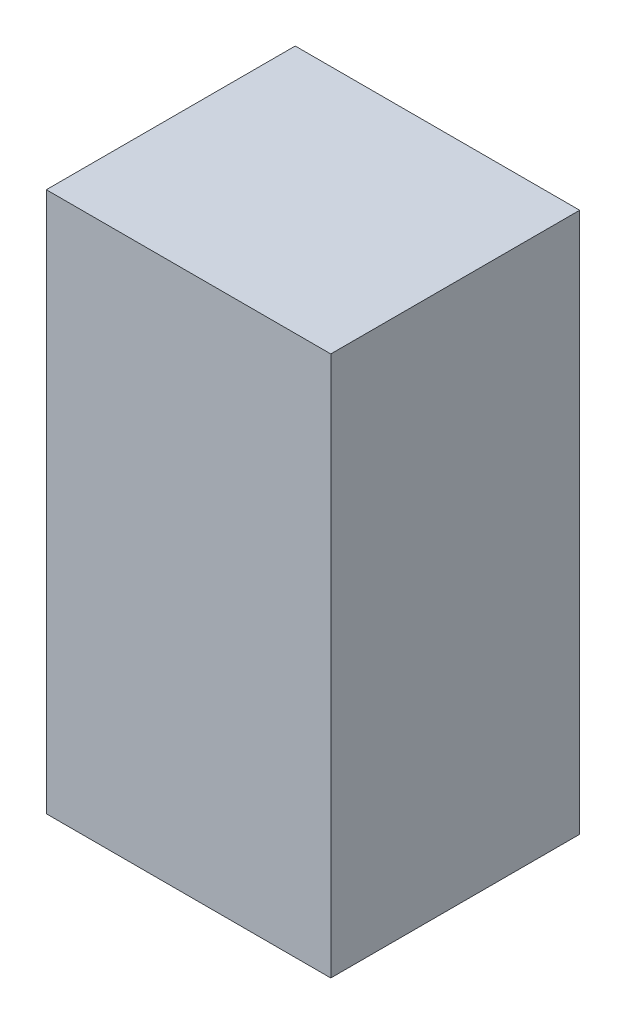
ISO-10303-21;
HEADER;
FILE_DESCRIPTION(('STEP AP214'),'2;1');
FILE_NAME('part.step','',(''),(''),'','','');
FILE_SCHEMA(('AUTOMOTIVE_DESIGN { 1 0 10303 214 1 1 1 1 }'));
ENDSEC;
DATA;
#1=APPLICATION_CONTEXT('core data for automotive mechanical design processes');
#2=APPLICATION_PROTOCOL_DEFINITION('international standard','automotive_design',2000,#1);
#3=PRODUCT_CONTEXT('',#1,'mechanical');
#4=PRODUCT('Part','Part','',(#3));
#5=PRODUCT_RELATED_PRODUCT_CATEGORY('part','',(#4));
#6=PRODUCT_DEFINITION_FORMATION('','',#4);
#7=PRODUCT_DEFINITION_CONTEXT('part definition',#1,'design');
#8=PRODUCT_DEFINITION('design','',#6,#7);
#9=PRODUCT_DEFINITION_SHAPE('','',#8);
#10=(LENGTH_UNIT() NAMED_UNIT(*) SI_UNIT(.MILLI.,.METRE.));
#11=(NAMED_UNIT(*) PLANE_ANGLE_UNIT() SI_UNIT($,.RADIAN.));
#12=(NAMED_UNIT(*) SI_UNIT($,.STERADIAN.) SOLID_ANGLE_UNIT());
#13=UNCERTAINTY_MEASURE_WITH_UNIT(LENGTH_MEASURE(1.E-05),#10,'distance_accuracy_value','');
#14=(GEOMETRIC_REPRESENTATION_CONTEXT(3) GLOBAL_UNCERTAINTY_ASSIGNED_CONTEXT((#13)) GLOBAL_UNIT_ASSIGNED_CONTEXT((#10,
#11,#12)) REPRESENTATION_CONTEXT('',''));
#15=CARTESIAN_POINT('',(0.,0.,0.));
#16=DIRECTION('',(0.,0.,1.));
#17=DIRECTION('',(1.,0.,0.));
#18=AXIS2_PLACEMENT_3D('',#15,#16,#17);
#19=CARTESIAN_POINT('',(-1.524,-2.8956,2.667));
#20=DIRECTION('',(0.,0.,1.));
#21=DIRECTION('',(1.,0.,0.));
#22=AXIS2_PLACEMENT_3D('',#19,#20,#21);
#23=PLANE('',#22);
#24=DIRECTION('',(1.,0.,0.));
#25=VECTOR('',#24,1.);
#26=CARTESIAN_POINT('',(-1.524,2.8956,2.667));
#27=LINE('',#26,#25);
#28=CARTESIAN_POINT('',(-1.524,2.8956,2.667));
#29=VERTEX_POINT('',#28);
#30=CARTESIAN_POINT('',(1.524,2.8956,2.667));
#31=VERTEX_POINT('',#30);
#32=EDGE_CURVE('E53',#29,#31,#27,.T.);
#33=ORIENTED_EDGE('',*,*,#32,.F.);
#34=DIRECTION('',(0.,1.,0.));
#35=VECTOR('',#34,1.);
#36=CARTESIAN_POINT('',(-1.524,-2.8956,2.667));
#37=LINE('',#36,#35);
#38=CARTESIAN_POINT('',(-1.524,-2.8956,2.667));
#39=VERTEX_POINT('',#38);
#40=EDGE_CURVE('E68',#39,#29,#37,.T.);
#41=ORIENTED_EDGE('',*,*,#40,.F.);
#42=DIRECTION('',(1.,0.,0.));
#43=VECTOR('',#42,1.);
#44=CARTESIAN_POINT('',(1.524,-2.8956,2.667));
#45=LINE('',#44,#43);
#46=CARTESIAN_POINT('',(1.524,-2.8956,2.667));
#47=VERTEX_POINT('',#46);
#48=EDGE_CURVE('E20',#47,#39,#45,.F.);
#49=ORIENTED_EDGE('',*,*,#48,.F.);
#50=DIRECTION('',(0.,1.,0.));
#51=VECTOR('',#50,1.);
#52=CARTESIAN_POINT('',(1.524,2.8956,2.667));
#53=LINE('',#52,#51);
#54=EDGE_CURVE('E58',#31,#47,#53,.F.);
#55=ORIENTED_EDGE('',*,*,#54,.F.);
#56=EDGE_LOOP('',(#33,#41,#49,#55));
#57=FACE_BOUND('',#56,.T.);
#58=ADVANCED_FACE('F17',(#57),#23,.T.);
#59=CARTESIAN_POINT('',(1.524,-2.8956,0.));
#60=DIRECTION('',(0.,-1.,0.));
#61=DIRECTION('',(0.,0.,-1.));
#62=AXIS2_PLACEMENT_3D('',#59,#60,#61);
#63=PLANE('',#62);
#64=DIRECTION('',(0.,0.,1.));
#65=VECTOR('',#64,1.);
#66=CARTESIAN_POINT('',(-1.524,-2.8956,0.));
#67=LINE('',#66,#65);
#68=CARTESIAN_POINT('',(-1.524,-2.8956,0.));
#69=VERTEX_POINT('',#68);
#70=EDGE_CURVE('E79',#69,#39,#67,.T.);
#71=ORIENTED_EDGE('',*,*,#70,.F.);
#72=DIRECTION('',(1.,0.,0.));
#73=VECTOR('',#72,1.);
#74=CARTESIAN_POINT('',(-1.524,-2.8956,0.));
#75=LINE('',#74,#73);
#76=CARTESIAN_POINT('',(1.524,-2.8956,0.));
#77=VERTEX_POINT('',#76);
#78=EDGE_CURVE('E74',#69,#77,#75,.T.);
#79=ORIENTED_EDGE('',*,*,#78,.T.);
#80=DIRECTION('',(0.,0.,-1.));
#81=VECTOR('',#80,1.);
#82=CARTESIAN_POINT('',(1.524,-2.8956,0.));
#83=LINE('',#82,#81);
#84=EDGE_CURVE('E63',#47,#77,#83,.T.);
#85=ORIENTED_EDGE('',*,*,#84,.F.);
#86=ORIENTED_EDGE('',*,*,#48,.T.);
#87=EDGE_LOOP('',(#71,#79,#85,#86));
#88=FACE_BOUND('',#87,.T.);
#89=ADVANCED_FACE('F73',(#88),#63,.T.);
#90=CARTESIAN_POINT('',(1.524,2.8956,0.));
#91=DIRECTION('',(1.,0.,0.));
#92=DIRECTION('',(0.,0.,-1.));
#93=AXIS2_PLACEMENT_3D('',#90,#91,#92);
#94=PLANE('',#93);
#95=ORIENTED_EDGE('',*,*,#84,.T.);
#96=DIRECTION('',(0.,1.,0.));
#97=VECTOR('',#96,1.);
#98=CARTESIAN_POINT('',(1.524,-2.8956,0.));
#99=LINE('',#98,#97);
#100=CARTESIAN_POINT('',(1.524,2.8956,0.));
#101=VERTEX_POINT('',#100);
#102=EDGE_CURVE('E84',#77,#101,#99,.T.);
#103=ORIENTED_EDGE('',*,*,#102,.T.);
#104=DIRECTION('',(0.,0.,1.));
#105=VECTOR('',#104,1.);
#106=CARTESIAN_POINT('',(1.524,2.8956,0.));
#107=LINE('',#106,#105);
#108=EDGE_CURVE('E65',#31,#101,#107,.F.);
#109=ORIENTED_EDGE('',*,*,#108,.F.);
#110=ORIENTED_EDGE('',*,*,#54,.T.);
#111=EDGE_LOOP('',(#95,#103,#109,#110));
#112=FACE_BOUND('',#111,.T.);
#113=ADVANCED_FACE('F60',(#112),#94,.T.);
#114=CARTESIAN_POINT('',(-1.524,2.8956,0.));
#115=DIRECTION('',(0.,1.,0.));
#116=DIRECTION('',(0.,0.,1.));
#117=AXIS2_PLACEMENT_3D('',#114,#115,#116);
#118=PLANE('',#117);
#119=ORIENTED_EDGE('',*,*,#108,.T.);
#120=DIRECTION('',(1.,0.,0.));
#121=VECTOR('',#120,1.);
#122=CARTESIAN_POINT('',(-1.524,2.8956,0.));
#123=LINE('',#122,#121);
#124=CARTESIAN_POINT('',(-1.524,2.8956,0.));
#125=VERTEX_POINT('',#124);
#126=EDGE_CURVE('E26',#101,#125,#123,.F.);
#127=ORIENTED_EDGE('',*,*,#126,.T.);
#128=DIRECTION('',(0.,0.,1.));
#129=VECTOR('',#128,1.);
#130=CARTESIAN_POINT('',(-1.524,2.8956,0.));
#131=LINE('',#130,#129);
#132=EDGE_CURVE('E34',#29,#125,#131,.F.);
#133=ORIENTED_EDGE('',*,*,#132,.F.);
#134=ORIENTED_EDGE('',*,*,#32,.T.);
#135=EDGE_LOOP('',(#119,#127,#133,#134));
#136=FACE_BOUND('',#135,.T.);
#137=ADVANCED_FACE('F88',(#136),#118,.T.);
#138=CARTESIAN_POINT('',(-1.524,-2.8956,0.));
#139=DIRECTION('',(-1.,0.,0.));
#140=DIRECTION('',(0.,0.,1.));
#141=AXIS2_PLACEMENT_3D('',#138,#139,#140);
#142=PLANE('',#141);
#143=ORIENTED_EDGE('',*,*,#132,.T.);
#144=DIRECTION('',(0.,1.,0.));
#145=VECTOR('',#144,1.);
#146=CARTESIAN_POINT('',(-1.524,-2.8956,0.));
#147=LINE('',#146,#145);
#148=EDGE_CURVE('E11',#125,#69,#147,.F.);
#149=ORIENTED_EDGE('',*,*,#148,.T.);
#150=ORIENTED_EDGE('',*,*,#70,.T.);
#151=ORIENTED_EDGE('',*,*,#40,.T.);
#152=EDGE_LOOP('',(#143,#149,#150,#151));
#153=FACE_BOUND('',#152,.T.);
#154=ADVANCED_FACE('F91',(#153),#142,.T.);
#155=CARTESIAN_POINT('',(-1.524,-2.8956,0.));
#156=DIRECTION('',(0.,0.,1.));
#157=DIRECTION('',(1.,0.,0.));
#158=AXIS2_PLACEMENT_3D('',#155,#156,#157);
#159=PLANE('',#158);
#160=ORIENTED_EDGE('',*,*,#126,.F.);
#161=ORIENTED_EDGE('',*,*,#102,.F.);
#162=ORIENTED_EDGE('',*,*,#78,.F.);
#163=ORIENTED_EDGE('',*,*,#148,.F.);
#164=EDGE_LOOP('',(#160,#161,#162,#163));
#165=FACE_BOUND('',#164,.T.);
#166=ADVANCED_FACE('F90',(#165),#159,.F.);
#167=CLOSED_SHELL('',(#58,#89,#113,#137,#154,#166));
#168=MANIFOLD_SOLID_BREP('B1',#167);
#169=ADVANCED_BREP_SHAPE_REPRESENTATION('',(#18,#168),#14);
#170=SHAPE_DEFINITION_REPRESENTATION(#9,#169);
ENDSEC;
END-ISO-10303-21;
